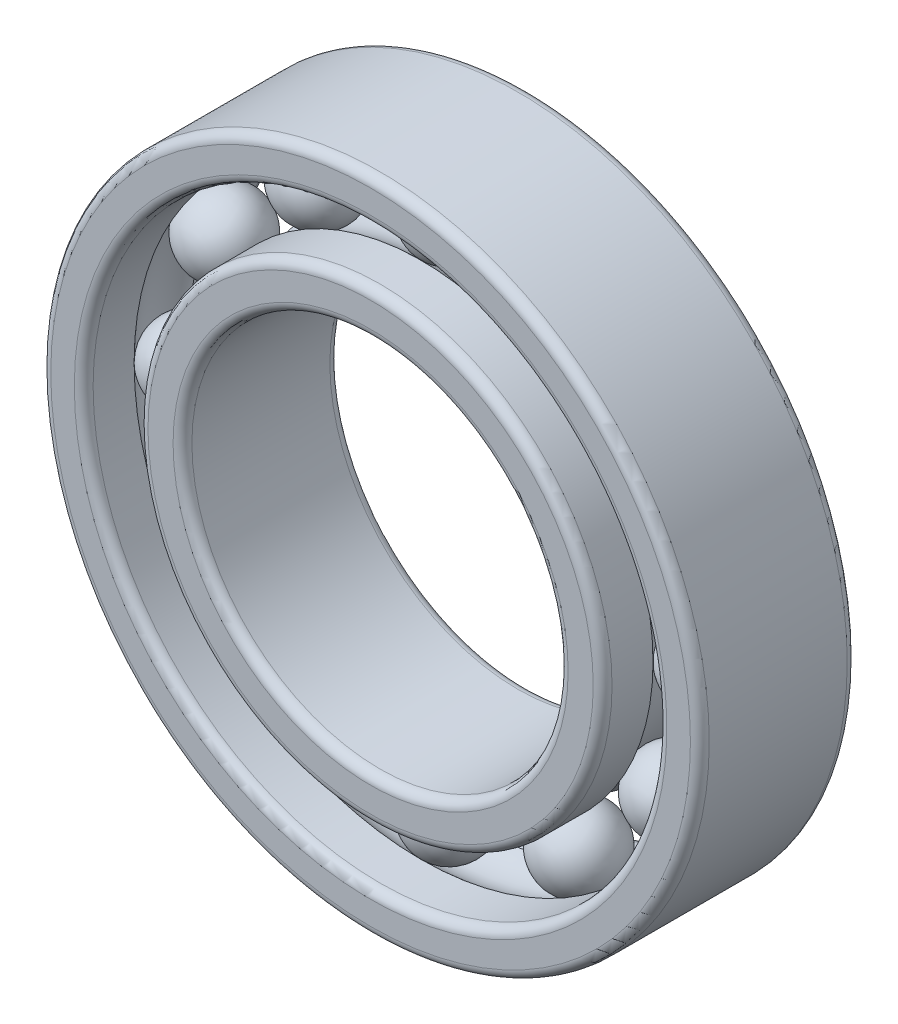
ISO-10303-21;
HEADER;
FILE_DESCRIPTION(('STEP AP214'),'2;1');
FILE_NAME('part.step','',(''),(''),'','','');
FILE_SCHEMA(('AUTOMOTIVE_DESIGN { 1 0 10303 214 1 1 1 1 }'));
ENDSEC;
DATA;
#1=APPLICATION_CONTEXT('core data for automotive mechanical design processes');
#2=APPLICATION_PROTOCOL_DEFINITION('international standard','automotive_design',2000,#1);
#3=PRODUCT_CONTEXT('',#1,'mechanical');
#4=PRODUCT('Part','Part','',(#3));
#5=PRODUCT_RELATED_PRODUCT_CATEGORY('part','',(#4));
#6=PRODUCT_DEFINITION_FORMATION('','',#4);
#7=PRODUCT_DEFINITION_CONTEXT('part definition',#1,'design');
#8=PRODUCT_DEFINITION('design','',#6,#7);
#9=PRODUCT_DEFINITION_SHAPE('','',#8);
#10=(LENGTH_UNIT() NAMED_UNIT(*) SI_UNIT(.MILLI.,.METRE.));
#11=(NAMED_UNIT(*) PLANE_ANGLE_UNIT() SI_UNIT($,.RADIAN.));
#12=(NAMED_UNIT(*) SI_UNIT($,.STERADIAN.) SOLID_ANGLE_UNIT());
#13=UNCERTAINTY_MEASURE_WITH_UNIT(LENGTH_MEASURE(1.E-05),#10,'distance_accuracy_value','');
#14=(GEOMETRIC_REPRESENTATION_CONTEXT(3) GLOBAL_UNCERTAINTY_ASSIGNED_CONTEXT((#13)) GLOBAL_UNIT_ASSIGNED_CONTEXT((#10,
#11,#12)) REPRESENTATION_CONTEXT('',''));
#15=CARTESIAN_POINT('',(0.,0.,0.));
#16=DIRECTION('',(0.,0.,1.));
#17=DIRECTION('',(1.,0.,0.));
#18=AXIS2_PLACEMENT_3D('',#15,#16,#17);
#19=CARTESIAN_POINT('',(4.13749999999991,7.16636021631628,0.));
#20=DIRECTION('',(0.,0.,1.));
#21=DIRECTION('',(0.499999999999989,0.866025403784445,0.));
#22=AXIS2_PLACEMENT_3D('',#19,#20,#21);
#23=SPHERICAL_SURFACE('',#22,1.25);
#24=CARTESIAN_POINT('',(4.13749999999991,7.16636021631628,1.25));
#25=VERTEX_POINT('',#24);
#26=VERTEX_LOOP('',#25);
#27=FACE_BOUND('',#26,.T.);
#28=ADVANCED_FACE('F38',(#27),#23,.T.);
#29=CLOSED_SHELL('',(#28));
#30=MANIFOLD_SOLID_BREP('B2',#29);
#31=CARTESIAN_POINT('',(7.16636021631618,4.13750000000008,0.));
#32=DIRECTION('',(0.,0.,1.));
#33=DIRECTION('',(0.866025403784433,0.50000000000001,0.));
#34=AXIS2_PLACEMENT_3D('',#31,#32,#33);
#35=SPHERICAL_SURFACE('',#34,1.25);
#36=CARTESIAN_POINT('',(7.16636021631618,4.13750000000008,1.25));
#37=VERTEX_POINT('',#36);
#38=VERTEX_LOOP('',#37);
#39=FACE_BOUND('',#38,.T.);
#40=ADVANCED_FACE('F57',(#39),#35,.T.);
#41=CLOSED_SHELL('',(#40));
#42=MANIFOLD_SOLID_BREP('B6',#41);
#43=CARTESIAN_POINT('',(8.275,0.,0.));
#44=DIRECTION('',(0.,0.,1.));
#45=DIRECTION('',(1.,0.,0.));
#46=AXIS2_PLACEMENT_3D('',#43,#44,#45);
#47=SPHERICAL_SURFACE('',#46,1.25);
#48=CARTESIAN_POINT('',(8.275,0.,1.25));
#49=VERTEX_POINT('',#48);
#50=VERTEX_LOOP('',#49);
#51=FACE_BOUND('',#50,.T.);
#52=ADVANCED_FACE('F76',(#51),#47,.T.);
#53=CLOSED_SHELL('',(#52));
#54=MANIFOLD_SOLID_BREP('B34',#53);
#55=CARTESIAN_POINT('',(7.16636021631627,-4.13749999999993,0.));
#56=DIRECTION('',(0.,0.,1.));
#57=DIRECTION('',(0.866025403784443,-0.499999999999992,0.));
#58=AXIS2_PLACEMENT_3D('',#55,#56,#57);
#59=SPHERICAL_SURFACE('',#58,1.25);
#60=CARTESIAN_POINT('',(7.16636021631627,-4.13749999999993,1.25));
#61=VERTEX_POINT('',#60);
#62=VERTEX_LOOP('',#61);
#63=FACE_BOUND('',#62,.T.);
#64=ADVANCED_FACE('F95',(#63),#59,.T.);
#65=CLOSED_SHELL('',(#64));
#66=MANIFOLD_SOLID_BREP('B53',#65);
#67=CARTESIAN_POINT('',(4.13750000000006,-7.1663602163162,0.));
#68=DIRECTION('',(0.,0.,1.));
#69=DIRECTION('',(0.500000000000007,-0.866025403784435,0.));
#70=AXIS2_PLACEMENT_3D('',#67,#68,#69);
#71=SPHERICAL_SURFACE('',#70,1.25);
#72=CARTESIAN_POINT('',(4.13750000000006,-7.1663602163162,1.25));
#73=VERTEX_POINT('',#72);
#74=VERTEX_LOOP('',#73);
#75=FACE_BOUND('',#74,.T.);
#76=ADVANCED_FACE('F114',(#75),#71,.T.);
#77=CLOSED_SHELL('',(#76));
#78=MANIFOLD_SOLID_BREP('B72',#77);
#79=CARTESIAN_POINT('',(0.,-8.275,0.));
#80=DIRECTION('',(0.,0.,1.));
#81=DIRECTION('',(0.,-1.,0.));
#82=AXIS2_PLACEMENT_3D('',#79,#80,#81);
#83=SPHERICAL_SURFACE('',#82,1.25);
#84=CARTESIAN_POINT('',(0.,-8.275,1.25));
#85=VERTEX_POINT('',#84);
#86=VERTEX_LOOP('',#85);
#87=FACE_BOUND('',#86,.T.);
#88=ADVANCED_FACE('F133',(#87),#83,.T.);
#89=CLOSED_SHELL('',(#88));
#90=MANIFOLD_SOLID_BREP('B91',#89);
#91=CARTESIAN_POINT('',(-4.13749999999996,-7.16636021631625,0.));
#92=DIRECTION('',(0.,0.,1.));
#93=DIRECTION('',(-0.499999999999995,-0.866025403784442,0.));
#94=AXIS2_PLACEMENT_3D('',#91,#92,#93);
#95=SPHERICAL_SURFACE('',#94,1.25);
#96=CARTESIAN_POINT('',(-4.13749999999996,-7.16636021631625,1.25));
#97=VERTEX_POINT('',#96);
#98=VERTEX_LOOP('',#97);
#99=FACE_BOUND('',#98,.T.);
#100=ADVANCED_FACE('F152',(#99),#95,.T.);
#101=CLOSED_SHELL('',(#100));
#102=MANIFOLD_SOLID_BREP('B110',#101);
#103=CARTESIAN_POINT('',(-7.16636021631621,-4.13750000000003,0.));
#104=DIRECTION('',(0.,0.,1.));
#105=DIRECTION('',(-0.866025403784436,-0.500000000000004,0.));
#106=AXIS2_PLACEMENT_3D('',#103,#104,#105);
#107=SPHERICAL_SURFACE('',#106,1.25);
#108=CARTESIAN_POINT('',(-7.16636021631621,-4.13750000000003,1.25));
#109=VERTEX_POINT('',#108);
#110=VERTEX_LOOP('',#109);
#111=FACE_BOUND('',#110,.T.);
#112=ADVANCED_FACE('F171',(#111),#107,.T.);
#113=CLOSED_SHELL('',(#112));
#114=MANIFOLD_SOLID_BREP('B129',#113);
#115=CARTESIAN_POINT('',(-8.275,0.,0.));
#116=DIRECTION('',(0.,0.,1.));
#117=DIRECTION('',(-1.,0.,0.));
#118=AXIS2_PLACEMENT_3D('',#115,#116,#117);
#119=SPHERICAL_SURFACE('',#118,1.25);
#120=CARTESIAN_POINT('',(-8.275,0.,1.25));
#121=VERTEX_POINT('',#120);
#122=VERTEX_LOOP('',#121);
#123=FACE_BOUND('',#122,.T.);
#124=ADVANCED_FACE('F190',(#123),#119,.T.);
#125=CLOSED_SHELL('',(#124));
#126=MANIFOLD_SOLID_BREP('B148',#125);
#127=CARTESIAN_POINT('',(-7.16636021631624,4.13749999999998,0.));
#128=DIRECTION('',(0.,0.,1.));
#129=DIRECTION('',(-0.86602540378444,0.499999999999998,0.));
#130=AXIS2_PLACEMENT_3D('',#127,#128,#129);
#131=SPHERICAL_SURFACE('',#130,1.25);
#132=CARTESIAN_POINT('',(-7.16636021631624,4.13749999999998,1.25));
#133=VERTEX_POINT('',#132);
#134=VERTEX_LOOP('',#133);
#135=FACE_BOUND('',#134,.T.);
#136=ADVANCED_FACE('F209',(#135),#131,.T.);
#137=CLOSED_SHELL('',(#136));
#138=MANIFOLD_SOLID_BREP('B167',#137);
#139=CARTESIAN_POINT('',(-4.13750000000001,7.16636021631623,0.));
#140=DIRECTION('',(0.,0.,1.));
#141=DIRECTION('',(-0.500000000000001,0.866025403784438,0.));
#142=AXIS2_PLACEMENT_3D('',#139,#140,#141);
#143=SPHERICAL_SURFACE('',#142,1.25);
#144=CARTESIAN_POINT('',(-4.13750000000001,7.16636021631623,1.25));
#145=VERTEX_POINT('',#144);
#146=VERTEX_LOOP('',#145);
#147=FACE_BOUND('',#146,.T.);
#148=ADVANCED_FACE('F228',(#147),#143,.T.);
#149=CLOSED_SHELL('',(#148));
#150=MANIFOLD_SOLID_BREP('B186',#149);
#151=CARTESIAN_POINT('',(0.,8.275,0.));
#152=DIRECTION('',(0.,0.,1.));
#153=DIRECTION('',(0.,1.,0.));
#154=AXIS2_PLACEMENT_3D('',#151,#152,#153);
#155=SPHERICAL_SURFACE('',#154,1.25);
#156=CARTESIAN_POINT('',(0.,8.275,1.25));
#157=VERTEX_POINT('',#156);
#158=VERTEX_LOOP('',#157);
#159=FACE_BOUND('',#158,.T.);
#160=ADVANCED_FACE('F249',(#159),#155,.T.);
#161=CLOSED_SHELL('',(#160));
#162=MANIFOLD_SOLID_BREP('B205',#161);
#163=CARTESIAN_POINT('',(0.,0.,0.));
#164=DIRECTION('',(0.,0.,1.));
#165=DIRECTION('',(1.,0.,0.));
#166=AXIS2_PLACEMENT_3D('',#163,#164,#165);
#167=TOROIDAL_SURFACE('',#166,8.275,1.25);
#168=CARTESIAN_POINT('',(0.,0.,-0.892678553567857));
#169=DIRECTION('',(0.,0.,1.));
#170=DIRECTION('',(1.,0.,0.));
#171=AXIS2_PLACEMENT_3D('',#168,#169,#170);
#172=CIRCLE('',#171,7.4);
#173=CARTESIAN_POINT('',(7.4,0.,-0.892678553567857));
#174=VERTEX_POINT('',#173);
#175=EDGE_CURVE('E304',#174,#174,#172,.T.);
#176=ORIENTED_EDGE('',*,*,#175,.T.);
#177=EDGE_LOOP('',(#176));
#178=FACE_BOUND('',#177,.T.);
#179=CARTESIAN_POINT('',(0.,0.,0.892678553567857));
#180=DIRECTION('',(0.,0.,1.));
#181=DIRECTION('',(1.,0.,0.));
#182=AXIS2_PLACEMENT_3D('',#179,#180,#181);
#183=CIRCLE('',#182,7.4);
#184=CARTESIAN_POINT('',(7.4,0.,0.892678553567857));
#185=VERTEX_POINT('',#184);
#186=EDGE_CURVE('E301',#185,#185,#183,.T.);
#187=ORIENTED_EDGE('',*,*,#186,.F.);
#188=EDGE_LOOP('',(#187));
#189=FACE_BOUND('',#188,.T.);
#190=ADVANCED_FACE('F269',(#178,#189),#167,.F.);
#191=CARTESIAN_POINT('',(0.,0.,0.));
#192=DIRECTION('',(0.,0.,1.));
#193=DIRECTION('',(1.,0.,0.));
#194=AXIS2_PLACEMENT_3D('',#191,#192,#193);
#195=CYLINDRICAL_SURFACE('',#194,7.4);
#196=CARTESIAN_POINT('',(0.,0.,2.2));
#197=DIRECTION('',(0.,0.,-1.));
#198=DIRECTION('',(-1.,0.,0.));
#199=AXIS2_PLACEMENT_3D('',#196,#197,#198);
#200=CIRCLE('',#199,7.4);
#201=CARTESIAN_POINT('',(-7.4,0.,2.2));
#202=VERTEX_POINT('',#201);
#203=EDGE_CURVE('E248',#202,#202,#200,.T.);
#204=ORIENTED_EDGE('',*,*,#203,.T.);
#205=EDGE_LOOP('',(#204));
#206=FACE_BOUND('',#205,.T.);
#207=ORIENTED_EDGE('',*,*,#186,.T.);
#208=EDGE_LOOP('',(#207));
#209=FACE_BOUND('',#208,.T.);
#210=ADVANCED_FACE('F327',(#206,#209),#195,.T.);
#211=CARTESIAN_POINT('',(0.,0.,2.5));
#212=DIRECTION('',(0.,0.,-1.));
#213=DIRECTION('',(-1.,0.,0.));
#214=AXIS2_PLACEMENT_3D('',#211,#212,#213);
#215=PLANE('',#214);
#216=CARTESIAN_POINT('',(0.,0.,2.5));
#217=DIRECTION('',(0.,0.,-1.));
#218=DIRECTION('',(-1.,0.,0.));
#219=AXIS2_PLACEMENT_3D('',#216,#217,#218);
#220=CIRCLE('',#219,7.1);
#221=CARTESIAN_POINT('',(-7.1,0.,2.5));
#222=VERTEX_POINT('',#221);
#223=EDGE_CURVE('E276',#222,#222,#220,.F.);
#224=ORIENTED_EDGE('',*,*,#223,.T.);
#225=EDGE_LOOP('',(#224));
#226=FACE_BOUND('',#225,.T.);
#227=CARTESIAN_POINT('',(0.,0.,2.5));
#228=DIRECTION('',(0.,0.,-1.));
#229=DIRECTION('',(-1.,0.,0.));
#230=AXIS2_PLACEMENT_3D('',#227,#228,#229);
#231=CIRCLE('',#230,6.3);
#232=CARTESIAN_POINT('',(-6.3,0.,2.5));
#233=VERTEX_POINT('',#232);
#234=EDGE_CURVE('E280',#233,#233,#231,.T.);
#235=ORIENTED_EDGE('',*,*,#234,.T.);
#236=EDGE_LOOP('',(#235));
#237=FACE_BOUND('',#236,.T.);
#238=ADVANCED_FACE('F332',(#226,#237),#215,.F.);
#239=CARTESIAN_POINT('',(0.,0.,0.));
#240=DIRECTION('',(0.,0.,1.));
#241=DIRECTION('',(1.,0.,0.));
#242=AXIS2_PLACEMENT_3D('',#239,#240,#241);
#243=CYLINDRICAL_SURFACE('',#242,6.);
#244=CARTESIAN_POINT('',(0.,0.,-2.2));
#245=DIRECTION('',(0.,0.,-1.));
#246=DIRECTION('',(-1.,0.,0.));
#247=AXIS2_PLACEMENT_3D('',#244,#245,#246);
#248=CIRCLE('',#247,6.);
#249=CARTESIAN_POINT('',(-6.,0.,-2.2));
#250=VERTEX_POINT('',#249);
#251=EDGE_CURVE('E284',#250,#250,#248,.T.);
#252=ORIENTED_EDGE('',*,*,#251,.T.);
#253=EDGE_LOOP('',(#252));
#254=FACE_BOUND('',#253,.T.);
#255=CARTESIAN_POINT('',(0.,0.,2.2));
#256=DIRECTION('',(0.,0.,-1.));
#257=DIRECTION('',(-1.,0.,0.));
#258=AXIS2_PLACEMENT_3D('',#255,#256,#257);
#259=CIRCLE('',#258,6.);
#260=CARTESIAN_POINT('',(-6.,0.,2.2));
#261=VERTEX_POINT('',#260);
#262=EDGE_CURVE('E289',#261,#261,#259,.F.);
#263=ORIENTED_EDGE('',*,*,#262,.T.);
#264=EDGE_LOOP('',(#263));
#265=FACE_BOUND('',#264,.T.);
#266=ADVANCED_FACE('F323',(#254,#265),#243,.F.);
#267=CARTESIAN_POINT('',(0.,0.,-2.5));
#268=DIRECTION('',(0.,0.,-1.));
#269=DIRECTION('',(-1.,0.,0.));
#270=AXIS2_PLACEMENT_3D('',#267,#268,#269);
#271=PLANE('',#270);
#272=CARTESIAN_POINT('',(0.,0.,-2.5));
#273=DIRECTION('',(0.,0.,-1.));
#274=DIRECTION('',(-1.,0.,0.));
#275=AXIS2_PLACEMENT_3D('',#272,#273,#274);
#276=CIRCLE('',#275,7.1);
#277=CARTESIAN_POINT('',(-7.1,0.,-2.5));
#278=VERTEX_POINT('',#277);
#279=EDGE_CURVE('E292',#278,#278,#276,.T.);
#280=ORIENTED_EDGE('',*,*,#279,.T.);
#281=EDGE_LOOP('',(#280));
#282=FACE_BOUND('',#281,.T.);
#283=CARTESIAN_POINT('',(0.,0.,-2.5));
#284=DIRECTION('',(0.,0.,-1.));
#285=DIRECTION('',(-1.,0.,0.));
#286=AXIS2_PLACEMENT_3D('',#283,#284,#285);
#287=CIRCLE('',#286,6.3);
#288=CARTESIAN_POINT('',(-6.3,0.,-2.5));
#289=VERTEX_POINT('',#288);
#290=EDGE_CURVE('E295',#289,#289,#287,.F.);
#291=ORIENTED_EDGE('',*,*,#290,.T.);
#292=EDGE_LOOP('',(#291));
#293=FACE_BOUND('',#292,.T.);
#294=ADVANCED_FACE('F313',(#282,#293),#271,.T.);
#295=CARTESIAN_POINT('',(0.,0.,0.));
#296=DIRECTION('',(0.,0.,1.));
#297=DIRECTION('',(1.,0.,0.));
#298=AXIS2_PLACEMENT_3D('',#295,#296,#297);
#299=CYLINDRICAL_SURFACE('',#298,7.4);
#300=CARTESIAN_POINT('',(0.,0.,-2.2));
#301=DIRECTION('',(0.,0.,-1.));
#302=DIRECTION('',(-1.,0.,0.));
#303=AXIS2_PLACEMENT_3D('',#300,#301,#302);
#304=CIRCLE('',#303,7.4);
#305=CARTESIAN_POINT('',(-7.4,0.,-2.2));
#306=VERTEX_POINT('',#305);
#307=EDGE_CURVE('E298',#306,#306,#304,.F.);
#308=ORIENTED_EDGE('',*,*,#307,.T.);
#309=EDGE_LOOP('',(#308));
#310=FACE_BOUND('',#309,.T.);
#311=ORIENTED_EDGE('',*,*,#175,.F.);
#312=EDGE_LOOP('',(#311));
#313=FACE_BOUND('',#312,.T.);
#314=ADVANCED_FACE('F310',(#310,#313),#299,.T.);
#315=CARTESIAN_POINT('',(0.,0.,-2.2));
#316=DIRECTION('',(0.,0.,-1.));
#317=DIRECTION('',(-1.,0.,0.));
#318=AXIS2_PLACEMENT_3D('',#315,#316,#317);
#319=TOROIDAL_SURFACE('',#318,7.1,0.3);
#320=ORIENTED_EDGE('',*,*,#279,.F.);
#321=EDGE_LOOP('',(#320));
#322=FACE_BOUND('',#321,.T.);
#323=ORIENTED_EDGE('',*,*,#307,.F.);
#324=EDGE_LOOP('',(#323));
#325=FACE_BOUND('',#324,.T.);
#326=ADVANCED_FACE('F312',(#322,#325),#319,.T.);
#327=CARTESIAN_POINT('',(0.,0.,-2.2));
#328=DIRECTION('',(0.,0.,-1.));
#329=DIRECTION('',(-1.,0.,0.));
#330=AXIS2_PLACEMENT_3D('',#327,#328,#329);
#331=TOROIDAL_SURFACE('',#330,6.3,0.3);
#332=ORIENTED_EDGE('',*,*,#251,.F.);
#333=EDGE_LOOP('',(#332));
#334=FACE_BOUND('',#333,.T.);
#335=ORIENTED_EDGE('',*,*,#290,.F.);
#336=EDGE_LOOP('',(#335));
#337=FACE_BOUND('',#336,.T.);
#338=ADVANCED_FACE('F320',(#334,#337),#331,.T.);
#339=CARTESIAN_POINT('',(0.,0.,2.2));
#340=DIRECTION('',(0.,0.,-1.));
#341=DIRECTION('',(-1.,0.,0.));
#342=AXIS2_PLACEMENT_3D('',#339,#340,#341);
#343=TOROIDAL_SURFACE('',#342,7.1,0.3);
#344=ORIENTED_EDGE('',*,*,#203,.F.);
#345=EDGE_LOOP('',(#344));
#346=FACE_BOUND('',#345,.T.);
#347=ORIENTED_EDGE('',*,*,#223,.F.);
#348=EDGE_LOOP('',(#347));
#349=FACE_BOUND('',#348,.T.);
#350=ADVANCED_FACE('F337',(#346,#349),#343,.T.);
#351=CARTESIAN_POINT('',(0.,0.,2.2));
#352=DIRECTION('',(0.,0.,-1.));
#353=DIRECTION('',(-1.,0.,0.));
#354=AXIS2_PLACEMENT_3D('',#351,#352,#353);
#355=TOROIDAL_SURFACE('',#354,6.3,0.3);
#356=ORIENTED_EDGE('',*,*,#234,.F.);
#357=EDGE_LOOP('',(#356));
#358=FACE_BOUND('',#357,.T.);
#359=ORIENTED_EDGE('',*,*,#262,.F.);
#360=EDGE_LOOP('',(#359));
#361=FACE_BOUND('',#360,.T.);
#362=ADVANCED_FACE('F271',(#358,#361),#355,.T.);
#363=CLOSED_SHELL('',(#190,#210,#238,#266,#294,#314,#326,#338,#350,#362));
#364=MANIFOLD_SOLID_BREP('B224',#363);
#365=CARTESIAN_POINT('',(0.,0.,0.));
#366=DIRECTION('',(0.,0.,1.));
#367=DIRECTION('',(1.,0.,0.));
#368=AXIS2_PLACEMENT_3D('',#365,#366,#367);
#369=TOROIDAL_SURFACE('',#368,8.275,1.25);
#370=CARTESIAN_POINT('',(0.,0.,0.892678553567857));
#371=DIRECTION('',(0.,0.,1.));
#372=DIRECTION('',(1.,0.,0.));
#373=AXIS2_PLACEMENT_3D('',#370,#371,#372);
#374=CIRCLE('',#373,9.15);
#375=CARTESIAN_POINT('',(9.15,0.,0.892678553567857));
#376=VERTEX_POINT('',#375);
#377=EDGE_CURVE('E456',#376,#376,#374,.T.);
#378=ORIENTED_EDGE('',*,*,#377,.T.);
#379=EDGE_LOOP('',(#378));
#380=FACE_BOUND('',#379,.T.);
#381=CARTESIAN_POINT('',(0.,0.,-0.892678553567857));
#382=DIRECTION('',(0.,0.,1.));
#383=DIRECTION('',(1.,0.,0.));
#384=AXIS2_PLACEMENT_3D('',#381,#382,#383);
#385=CIRCLE('',#384,9.15);
#386=CARTESIAN_POINT('',(9.15,0.,-0.892678553567857));
#387=VERTEX_POINT('',#386);
#388=EDGE_CURVE('E453',#387,#387,#385,.T.);
#389=ORIENTED_EDGE('',*,*,#388,.F.);
#390=EDGE_LOOP('',(#389));
#391=FACE_BOUND('',#390,.T.);
#392=ADVANCED_FACE('F421',(#380,#391),#369,.F.);
#393=CARTESIAN_POINT('',(0.,0.,0.));
#394=DIRECTION('',(0.,0.,1.));
#395=DIRECTION('',(1.,0.,0.));
#396=AXIS2_PLACEMENT_3D('',#393,#394,#395);
#397=CYLINDRICAL_SURFACE('',#396,9.15);
#398=CARTESIAN_POINT('',(0.,0.,-2.2));
#399=DIRECTION('',(0.,0.,-1.));
#400=DIRECTION('',(-1.,0.,0.));
#401=AXIS2_PLACEMENT_3D('',#398,#399,#400);
#402=CIRCLE('',#401,9.15);
#403=CARTESIAN_POINT('',(-9.15,0.,-2.2));
#404=VERTEX_POINT('',#403);
#405=EDGE_CURVE('E444',#404,#404,#402,.T.);
#406=ORIENTED_EDGE('',*,*,#405,.T.);
#407=EDGE_LOOP('',(#406));
#408=FACE_BOUND('',#407,.T.);
#409=ORIENTED_EDGE('',*,*,#388,.T.);
#410=EDGE_LOOP('',(#409));
#411=FACE_BOUND('',#410,.T.);
#412=ADVANCED_FACE('F479',(#408,#411),#397,.F.);
#413=CARTESIAN_POINT('',(0.,0.,-2.5));
#414=DIRECTION('',(0.,0.,-1.));
#415=DIRECTION('',(-1.,0.,0.));
#416=AXIS2_PLACEMENT_3D('',#413,#414,#415);
#417=PLANE('',#416);
#418=CARTESIAN_POINT('',(0.,0.,-2.5));
#419=DIRECTION('',(0.,0.,-1.));
#420=DIRECTION('',(-1.,0.,0.));
#421=AXIS2_PLACEMENT_3D('',#418,#419,#420);
#422=CIRCLE('',#421,9.45);
#423=CARTESIAN_POINT('',(-9.45,0.,-2.5));
#424=VERTEX_POINT('',#423);
#425=EDGE_CURVE('E447',#424,#424,#422,.F.);
#426=ORIENTED_EDGE('',*,*,#425,.T.);
#427=EDGE_LOOP('',(#426));
#428=FACE_BOUND('',#427,.T.);
#429=CARTESIAN_POINT('',(0.,0.,-2.5));
#430=DIRECTION('',(0.,0.,-1.));
#431=DIRECTION('',(-1.,0.,0.));
#432=AXIS2_PLACEMENT_3D('',#429,#430,#431);
#433=CIRCLE('',#432,10.2);
#434=CARTESIAN_POINT('',(-10.2,0.,-2.5));
#435=VERTEX_POINT('',#434);
#436=EDGE_CURVE('E450',#435,#435,#433,.T.);
#437=ORIENTED_EDGE('',*,*,#436,.T.);
#438=EDGE_LOOP('',(#437));
#439=FACE_BOUND('',#438,.T.);
#440=ADVANCED_FACE('F484',(#428,#439),#417,.T.);
#441=CARTESIAN_POINT('',(0.,0.,0.));
#442=DIRECTION('',(0.,0.,1.));
#443=DIRECTION('',(1.,0.,0.));
#444=AXIS2_PLACEMENT_3D('',#441,#442,#443);
#445=CYLINDRICAL_SURFACE('',#444,10.5);
#446=CARTESIAN_POINT('',(0.,0.,-2.2));
#447=DIRECTION('',(0.,0.,-1.));
#448=DIRECTION('',(-1.,0.,0.));
#449=AXIS2_PLACEMENT_3D('',#446,#447,#448);
#450=CIRCLE('',#449,10.5);
#451=CARTESIAN_POINT('',(-10.5,0.,-2.2));
#452=VERTEX_POINT('',#451);
#453=EDGE_CURVE('E268',#452,#452,#450,.F.);
#454=ORIENTED_EDGE('',*,*,#453,.T.);
#455=EDGE_LOOP('',(#454));
#456=FACE_BOUND('',#455,.T.);
#457=CARTESIAN_POINT('',(0.,0.,2.2));
#458=DIRECTION('',(0.,0.,-1.));
#459=DIRECTION('',(-1.,0.,0.));
#460=AXIS2_PLACEMENT_3D('',#457,#458,#459);
#461=CIRCLE('',#460,10.5);
#462=CARTESIAN_POINT('',(-10.5,0.,2.2));
#463=VERTEX_POINT('',#462);
#464=EDGE_CURVE('E428',#463,#463,#461,.T.);
#465=ORIENTED_EDGE('',*,*,#464,.T.);
#466=EDGE_LOOP('',(#465));
#467=FACE_BOUND('',#466,.T.);
#468=ADVANCED_FACE('F475',(#456,#467),#445,.T.);
#469=CARTESIAN_POINT('',(0.,0.,2.5));
#470=DIRECTION('',(0.,0.,-1.));
#471=DIRECTION('',(-1.,0.,0.));
#472=AXIS2_PLACEMENT_3D('',#469,#470,#471);
#473=PLANE('',#472);
#474=CARTESIAN_POINT('',(0.,0.,2.5));
#475=DIRECTION('',(0.,0.,-1.));
#476=DIRECTION('',(-1.,0.,0.));
#477=AXIS2_PLACEMENT_3D('',#474,#475,#476);
#478=CIRCLE('',#477,9.45);
#479=CARTESIAN_POINT('',(-9.45,0.,2.5));
#480=VERTEX_POINT('',#479);
#481=EDGE_CURVE('E432',#480,#480,#478,.T.);
#482=ORIENTED_EDGE('',*,*,#481,.T.);
#483=EDGE_LOOP('',(#482));
#484=FACE_BOUND('',#483,.T.);
#485=CARTESIAN_POINT('',(0.,0.,2.5));
#486=DIRECTION('',(0.,0.,-1.));
#487=DIRECTION('',(-1.,0.,0.));
#488=AXIS2_PLACEMENT_3D('',#485,#486,#487);
#489=CIRCLE('',#488,10.2);
#490=CARTESIAN_POINT('',(-10.2,0.,2.5));
#491=VERTEX_POINT('',#490);
#492=EDGE_CURVE('E436',#491,#491,#489,.F.);
#493=ORIENTED_EDGE('',*,*,#492,.T.);
#494=EDGE_LOOP('',(#493));
#495=FACE_BOUND('',#494,.T.);
#496=ADVANCED_FACE('F465',(#484,#495),#473,.F.);
#497=CARTESIAN_POINT('',(0.,0.,0.));
#498=DIRECTION('',(0.,0.,1.));
#499=DIRECTION('',(1.,0.,0.));
#500=AXIS2_PLACEMENT_3D('',#497,#498,#499);
#501=CYLINDRICAL_SURFACE('',#500,9.15);
#502=CARTESIAN_POINT('',(0.,0.,2.2));
#503=DIRECTION('',(0.,0.,-1.));
#504=DIRECTION('',(-1.,0.,0.));
#505=AXIS2_PLACEMENT_3D('',#502,#503,#504);
#506=CIRCLE('',#505,9.15);
#507=CARTESIAN_POINT('',(-9.15,0.,2.2));
#508=VERTEX_POINT('',#507);
#509=EDGE_CURVE('E441',#508,#508,#506,.F.);
#510=ORIENTED_EDGE('',*,*,#509,.T.);
#511=EDGE_LOOP('',(#510));
#512=FACE_BOUND('',#511,.T.);
#513=ORIENTED_EDGE('',*,*,#377,.F.);
#514=EDGE_LOOP('',(#513));
#515=FACE_BOUND('',#514,.T.);
#516=ADVANCED_FACE('F462',(#512,#515),#501,.F.);
#517=CARTESIAN_POINT('',(0.,0.,-2.2));
#518=DIRECTION('',(0.,0.,-1.));
#519=DIRECTION('',(-1.,0.,0.));
#520=AXIS2_PLACEMENT_3D('',#517,#518,#519);
#521=TOROIDAL_SURFACE('',#520,9.45,0.3);
#522=ORIENTED_EDGE('',*,*,#405,.F.);
#523=EDGE_LOOP('',(#522));
#524=FACE_BOUND('',#523,.T.);
#525=ORIENTED_EDGE('',*,*,#425,.F.);
#526=EDGE_LOOP('',(#525));
#527=FACE_BOUND('',#526,.T.);
#528=ADVANCED_FACE('F464',(#524,#527),#521,.T.);
#529=CARTESIAN_POINT('',(0.,0.,2.2));
#530=DIRECTION('',(0.,0.,-1.));
#531=DIRECTION('',(-1.,0.,0.));
#532=AXIS2_PLACEMENT_3D('',#529,#530,#531);
#533=TOROIDAL_SURFACE('',#532,9.45,0.3);
#534=ORIENTED_EDGE('',*,*,#481,.F.);
#535=EDGE_LOOP('',(#534));
#536=FACE_BOUND('',#535,.T.);
#537=ORIENTED_EDGE('',*,*,#509,.F.);
#538=EDGE_LOOP('',(#537));
#539=FACE_BOUND('',#538,.T.);
#540=ADVANCED_FACE('F472',(#536,#539),#533,.T.);
#541=CARTESIAN_POINT('',(0.,0.,-2.2));
#542=DIRECTION('',(0.,0.,-1.));
#543=DIRECTION('',(-1.,0.,0.));
#544=AXIS2_PLACEMENT_3D('',#541,#542,#543);
#545=TOROIDAL_SURFACE('',#544,10.2,0.3);
#546=ORIENTED_EDGE('',*,*,#436,.F.);
#547=EDGE_LOOP('',(#546));
#548=FACE_BOUND('',#547,.T.);
#549=ORIENTED_EDGE('',*,*,#453,.F.);
#550=EDGE_LOOP('',(#549));
#551=FACE_BOUND('',#550,.T.);
#552=ADVANCED_FACE('F490',(#548,#551),#545,.T.);
#553=CARTESIAN_POINT('',(0.,0.,2.2));
#554=DIRECTION('',(0.,0.,-1.));
#555=DIRECTION('',(-1.,0.,0.));
#556=AXIS2_PLACEMENT_3D('',#553,#554,#555);
#557=TOROIDAL_SURFACE('',#556,10.2,0.3);
#558=ORIENTED_EDGE('',*,*,#464,.F.);
#559=EDGE_LOOP('',(#558));
#560=FACE_BOUND('',#559,.T.);
#561=ORIENTED_EDGE('',*,*,#492,.F.);
#562=EDGE_LOOP('',(#561));
#563=FACE_BOUND('',#562,.T.);
#564=ADVANCED_FACE('F423',(#560,#563),#557,.T.);
#565=CLOSED_SHELL('',(#392,#412,#440,#468,#496,#516,#528,#540,#552,#564));
#566=MANIFOLD_SOLID_BREP('B243',#565);
#567=ADVANCED_BREP_SHAPE_REPRESENTATION('',(#18,#30,#42,#54,#66,#78,#90,#102,#114,#126,#138,
#150,#162,#364,#566),#14);
#568=SHAPE_DEFINITION_REPRESENTATION(#9,#567);
ENDSEC;
END-ISO-10303-21;
